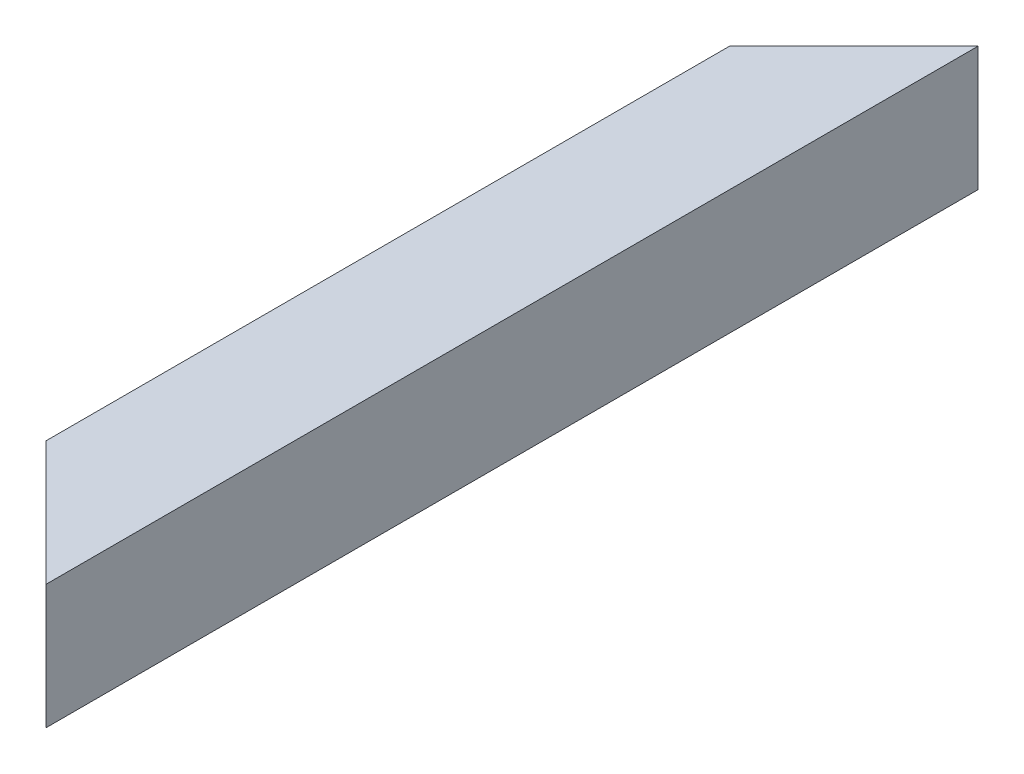
ISO-10303-21;
HEADER;
FILE_DESCRIPTION(('STEP AP214'),'2;1');
FILE_NAME('part.step','',(''),(''),'','','');
FILE_SCHEMA(('AUTOMOTIVE_DESIGN { 1 0 10303 214 1 1 1 1 }'));
ENDSEC;
DATA;
#1=APPLICATION_CONTEXT('core data for automotive mechanical design processes');
#2=APPLICATION_PROTOCOL_DEFINITION('international standard','automotive_design',2000,#1);
#3=PRODUCT_CONTEXT('',#1,'mechanical');
#4=PRODUCT('Part','Part','',(#3));
#5=PRODUCT_RELATED_PRODUCT_CATEGORY('part','',(#4));
#6=PRODUCT_DEFINITION_FORMATION('','',#4);
#7=PRODUCT_DEFINITION_CONTEXT('part definition',#1,'design');
#8=PRODUCT_DEFINITION('design','',#6,#7);
#9=PRODUCT_DEFINITION_SHAPE('','',#8);
#10=(LENGTH_UNIT() NAMED_UNIT(*) SI_UNIT(.MILLI.,.METRE.));
#11=(NAMED_UNIT(*) PLANE_ANGLE_UNIT() SI_UNIT($,.RADIAN.));
#12=(NAMED_UNIT(*) SI_UNIT($,.STERADIAN.) SOLID_ANGLE_UNIT());
#13=UNCERTAINTY_MEASURE_WITH_UNIT(LENGTH_MEASURE(1.E-05),#10,'distance_accuracy_value','');
#14=(GEOMETRIC_REPRESENTATION_CONTEXT(3) GLOBAL_UNCERTAINTY_ASSIGNED_CONTEXT((#13)) GLOBAL_UNIT_ASSIGNED_CONTEXT((#10,
#11,#12)) REPRESENTATION_CONTEXT('',''));
#15=CARTESIAN_POINT('',(0.,0.,0.));
#16=DIRECTION('',(0.,0.,1.));
#17=DIRECTION('',(1.,0.,0.));
#18=AXIS2_PLACEMENT_3D('',#15,#16,#17);
#19=CARTESIAN_POINT('',(-16.,16.,0.));
#20=DIRECTION('',(1.,0.,0.));
#21=DIRECTION('',(0.,0.,-1.));
#22=AXIS2_PLACEMENT_3D('',#19,#20,#21);
#23=PLANE('',#22);
#24=DIRECTION('',(0.,-1.,0.));
#25=VECTOR('',#24,1.);
#26=CARTESIAN_POINT('',(-16.,16.,35.9999999999996));
#27=LINE('',#26,#25);
#28=CARTESIAN_POINT('',(-16.,16.,35.9999999999996));
#29=VERTEX_POINT('',#28);
#30=CARTESIAN_POINT('',(-16.,-16.,35.9999999999996));
#31=VERTEX_POINT('',#30);
#32=EDGE_CURVE('E11',#29,#31,#27,.T.);
#33=ORIENTED_EDGE('',*,*,#32,.F.);
#34=DIRECTION('',(0.,0.,1.));
#35=VECTOR('',#34,1.);
#36=CARTESIAN_POINT('',(-16.,16.,0.));
#37=LINE('',#36,#35);
#38=CARTESIAN_POINT('',(-16.,16.,264.000000000001));
#39=VERTEX_POINT('',#38);
#40=EDGE_CURVE('E148',#29,#39,#37,.T.);
#41=ORIENTED_EDGE('',*,*,#40,.T.);
#42=DIRECTION('',(0.,1.,0.));
#43=VECTOR('',#42,1.);
#44=CARTESIAN_POINT('',(-16.,16.,264.000000000001));
#45=LINE('',#44,#43);
#46=CARTESIAN_POINT('',(-16.,-16.,264.000000000001));
#47=VERTEX_POINT('',#46);
#48=EDGE_CURVE('E46',#47,#39,#45,.T.);
#49=ORIENTED_EDGE('',*,*,#48,.F.);
#50=DIRECTION('',(0.,0.,1.));
#51=VECTOR('',#50,1.);
#52=CARTESIAN_POINT('',(-16.,-16.,0.));
#53=LINE('',#52,#51);
#54=EDGE_CURVE('E135',#31,#47,#53,.T.);
#55=ORIENTED_EDGE('',*,*,#54,.F.);
#56=EDGE_LOOP('',(#33,#41,#49,#55));
#57=FACE_BOUND('',#56,.T.);
#58=ADVANCED_FACE('F38',(#57),#23,.T.);
#59=CARTESIAN_POINT('',(-16.,-16.,0.));
#60=DIRECTION('',(0.,1.,0.));
#61=DIRECTION('',(0.,0.,1.));
#62=AXIS2_PLACEMENT_3D('',#59,#60,#61);
#63=PLANE('',#62);
#64=DIRECTION('',(0.707106781186551,0.,-0.707106781186544));
#65=VECTOR('',#64,1.);
#66=CARTESIAN_POINT('',(1.99999999999982,-16.,18.));
#67=LINE('',#66,#65);
#68=CARTESIAN_POINT('',(16.,-16.,3.99999999999997));
#69=VERTEX_POINT('',#68);
#70=EDGE_CURVE('E168',#31,#69,#67,.T.);
#71=ORIENTED_EDGE('',*,*,#70,.F.);
#72=ORIENTED_EDGE('',*,*,#54,.T.);
#73=DIRECTION('',(-0.707106781186552,0.,-0.707106781186543));
#74=VECTOR('',#73,1.);
#75=CARTESIAN_POINT('',(-148.,-16.,132.000000000002));
#76=LINE('',#75,#74);
#77=CARTESIAN_POINT('',(16.,-16.,296.));
#78=VERTEX_POINT('',#77);
#79=EDGE_CURVE('E60',#78,#47,#76,.T.);
#80=ORIENTED_EDGE('',*,*,#79,.F.);
#81=DIRECTION('',(0.,0.,1.));
#82=VECTOR('',#81,1.);
#83=CARTESIAN_POINT('',(16.,-16.,0.));
#84=LINE('',#83,#82);
#85=EDGE_CURVE('E138',#69,#78,#84,.T.);
#86=ORIENTED_EDGE('',*,*,#85,.F.);
#87=EDGE_LOOP('',(#71,#72,#80,#86));
#88=FACE_BOUND('',#87,.T.);
#89=ADVANCED_FACE('F184',(#88),#63,.T.);
#90=CARTESIAN_POINT('',(16.,16.,0.));
#91=DIRECTION('',(-1.,0.,0.));
#92=DIRECTION('',(0.,0.,1.));
#93=AXIS2_PLACEMENT_3D('',#90,#91,#92);
#94=PLANE('',#93);
#95=DIRECTION('',(0.,1.,0.));
#96=VECTOR('',#95,1.);
#97=CARTESIAN_POINT('',(16.,16.,3.99999999999997));
#98=LINE('',#97,#96);
#99=CARTESIAN_POINT('',(16.,16.,3.99999999999997));
#100=VERTEX_POINT('',#99);
#101=EDGE_CURVE('E170',#69,#100,#98,.T.);
#102=ORIENTED_EDGE('',*,*,#101,.F.);
#103=ORIENTED_EDGE('',*,*,#85,.T.);
#104=DIRECTION('',(0.,-1.,0.));
#105=VECTOR('',#104,1.);
#106=CARTESIAN_POINT('',(16.,16.,296.));
#107=LINE('',#106,#105);
#108=CARTESIAN_POINT('',(16.,16.,296.));
#109=VERTEX_POINT('',#108);
#110=EDGE_CURVE('E164',#109,#78,#107,.T.);
#111=ORIENTED_EDGE('',*,*,#110,.F.);
#112=DIRECTION('',(0.,0.,1.));
#113=VECTOR('',#112,1.);
#114=CARTESIAN_POINT('',(16.,16.,0.));
#115=LINE('',#114,#113);
#116=EDGE_CURVE('E144',#100,#109,#115,.T.);
#117=ORIENTED_EDGE('',*,*,#116,.F.);
#118=EDGE_LOOP('',(#102,#103,#111,#117));
#119=FACE_BOUND('',#118,.T.);
#120=ADVANCED_FACE('F181',(#119),#94,.T.);
#121=CARTESIAN_POINT('',(-16.,16.,0.));
#122=DIRECTION('',(0.,-1.,0.));
#123=DIRECTION('',(0.,0.,-1.));
#124=AXIS2_PLACEMENT_3D('',#121,#122,#123);
#125=PLANE('',#124);
#126=DIRECTION('',(-0.707106781186551,0.,0.707106781186544));
#127=VECTOR('',#126,1.);
#128=CARTESIAN_POINT('',(1.99999999999982,16.,18.));
#129=LINE('',#128,#127);
#130=EDGE_CURVE('E52',#100,#29,#129,.T.);
#131=ORIENTED_EDGE('',*,*,#130,.F.);
#132=ORIENTED_EDGE('',*,*,#116,.T.);
#133=DIRECTION('',(0.707106781186552,0.,0.707106781186543));
#134=VECTOR('',#133,1.);
#135=CARTESIAN_POINT('',(-148.,16.,132.000000000002));
#136=LINE('',#135,#134);
#137=EDGE_CURVE('E166',#39,#109,#136,.T.);
#138=ORIENTED_EDGE('',*,*,#137,.F.);
#139=ORIENTED_EDGE('',*,*,#40,.F.);
#140=EDGE_LOOP('',(#131,#132,#138,#139));
#141=FACE_BOUND('',#140,.T.);
#142=ADVANCED_FACE('F176',(#141),#125,.T.);
#143=CARTESIAN_POINT('',(20.,-20.,300.));
#144=DIRECTION('',(0.707106781186543,0.,-0.707106781186552));
#145=DIRECTION('',(-0.707106781186552,0.,-0.707106781186543));
#146=AXIS2_PLACEMENT_3D('',#143,#144,#145);
#147=PLANE('',#146);
#148=ORIENTED_EDGE('',*,*,#137,.T.);
#149=ORIENTED_EDGE('',*,*,#110,.T.);
#150=ORIENTED_EDGE('',*,*,#79,.T.);
#151=ORIENTED_EDGE('',*,*,#48,.T.);
#152=EDGE_LOOP('',(#148,#149,#150,#151));
#153=FACE_BOUND('',#152,.T.);
#154=DIRECTION('',(-0.707106781186552,0.,-0.707106781186543));
#155=VECTOR('',#154,1.);
#156=CARTESIAN_POINT('',(20.,20.,300.));
#157=LINE('',#156,#155);
#158=CARTESIAN_POINT('',(20.,20.,300.));
#159=VERTEX_POINT('',#158);
#160=CARTESIAN_POINT('',(-20.,20.,260.000000000001));
#161=VERTEX_POINT('',#160);
#162=EDGE_CURVE('E157',#159,#161,#157,.T.);
#163=ORIENTED_EDGE('',*,*,#162,.T.);
#164=DIRECTION('',(0.,1.,0.));
#165=VECTOR('',#164,1.);
#166=CARTESIAN_POINT('',(-20.,-20.,260.000000000001));
#167=LINE('',#166,#165);
#168=CARTESIAN_POINT('',(-20.,-20.,260.000000000001));
#169=VERTEX_POINT('',#168);
#170=EDGE_CURVE('E159',#169,#161,#167,.T.);
#171=ORIENTED_EDGE('',*,*,#170,.F.);
#172=DIRECTION('',(-0.707106781186552,0.,-0.707106781186543));
#173=VECTOR('',#172,1.);
#174=CARTESIAN_POINT('',(20.,-20.,300.));
#175=LINE('',#174,#173);
#176=CARTESIAN_POINT('',(20.,-20.,300.));
#177=VERTEX_POINT('',#176);
#178=EDGE_CURVE('E125',#177,#169,#175,.T.);
#179=ORIENTED_EDGE('',*,*,#178,.F.);
#180=DIRECTION('',(0.,1.,0.));
#181=VECTOR('',#180,1.);
#182=CARTESIAN_POINT('',(20.,20.,300.));
#183=LINE('',#182,#181);
#184=EDGE_CURVE('E147',#177,#159,#183,.T.);
#185=ORIENTED_EDGE('',*,*,#184,.T.);
#186=EDGE_LOOP('',(#163,#171,#179,#185));
#187=FACE_BOUND('',#186,.T.);
#188=ADVANCED_FACE('F183',(#153,#187),#147,.F.);
#189=CARTESIAN_POINT('',(20.,-20.,0.));
#190=DIRECTION('',(0.707106781186544,0.,0.707106781186551));
#191=DIRECTION('',(0.707106781186551,0.,-0.707106781186544));
#192=AXIS2_PLACEMENT_3D('',#189,#190,#191);
#193=PLANE('',#192);
#194=ORIENTED_EDGE('',*,*,#130,.T.);
#195=ORIENTED_EDGE('',*,*,#32,.T.);
#196=ORIENTED_EDGE('',*,*,#70,.T.);
#197=ORIENTED_EDGE('',*,*,#101,.T.);
#198=EDGE_LOOP('',(#194,#195,#196,#197));
#199=FACE_BOUND('',#198,.T.);
#200=DIRECTION('',(0.707106781186551,0.,-0.707106781186544));
#201=VECTOR('',#200,1.);
#202=CARTESIAN_POINT('',(20.,20.,0.));
#203=LINE('',#202,#201);
#204=CARTESIAN_POINT('',(-20.,20.,39.9999999999996));
#205=VERTEX_POINT('',#204);
#206=CARTESIAN_POINT('',(20.,20.,0.));
#207=VERTEX_POINT('',#206);
#208=EDGE_CURVE('E112',#205,#207,#203,.T.);
#209=ORIENTED_EDGE('',*,*,#208,.T.);
#210=DIRECTION('',(0.,1.,0.));
#211=VECTOR('',#210,1.);
#212=CARTESIAN_POINT('',(20.,20.,0.));
#213=LINE('',#212,#211);
#214=CARTESIAN_POINT('',(20.,-20.,0.));
#215=VERTEX_POINT('',#214);
#216=EDGE_CURVE('E107',#215,#207,#213,.T.);
#217=ORIENTED_EDGE('',*,*,#216,.F.);
#218=DIRECTION('',(0.707106781186551,0.,-0.707106781186544));
#219=VECTOR('',#218,1.);
#220=CARTESIAN_POINT('',(20.,-20.,0.));
#221=LINE('',#220,#219);
#222=CARTESIAN_POINT('',(-20.,-20.,39.9999999999996));
#223=VERTEX_POINT('',#222);
#224=EDGE_CURVE('E101',#223,#215,#221,.T.);
#225=ORIENTED_EDGE('',*,*,#224,.F.);
#226=DIRECTION('',(0.,1.,0.));
#227=VECTOR('',#226,1.);
#228=CARTESIAN_POINT('',(-20.,-20.,39.9999999999996));
#229=LINE('',#228,#227);
#230=EDGE_CURVE('E104',#223,#205,#229,.T.);
#231=ORIENTED_EDGE('',*,*,#230,.T.);
#232=EDGE_LOOP('',(#209,#217,#225,#231));
#233=FACE_BOUND('',#232,.T.);
#234=ADVANCED_FACE('F103',(#199,#233),#193,.F.);
#235=CARTESIAN_POINT('',(-20.,20.,0.));
#236=DIRECTION('',(-1.,0.,0.));
#237=DIRECTION('',(0.,0.,1.));
#238=AXIS2_PLACEMENT_3D('',#235,#236,#237);
#239=PLANE('',#238);
#240=ORIENTED_EDGE('',*,*,#230,.F.);
#241=DIRECTION('',(0.,0.,1.));
#242=VECTOR('',#241,1.);
#243=CARTESIAN_POINT('',(-20.,-20.,0.));
#244=LINE('',#243,#242);
#245=EDGE_CURVE('E119',#223,#169,#244,.T.);
#246=ORIENTED_EDGE('',*,*,#245,.T.);
#247=ORIENTED_EDGE('',*,*,#170,.T.);
#248=DIRECTION('',(0.,0.,1.));
#249=VECTOR('',#248,1.);
#250=CARTESIAN_POINT('',(-20.,20.,0.));
#251=LINE('',#250,#249);
#252=EDGE_CURVE('E121',#205,#161,#251,.T.);
#253=ORIENTED_EDGE('',*,*,#252,.F.);
#254=EDGE_LOOP('',(#240,#246,#247,#253));
#255=FACE_BOUND('',#254,.T.);
#256=ADVANCED_FACE('F117',(#255),#239,.T.);
#257=CARTESIAN_POINT('',(-20.,-20.,0.));
#258=DIRECTION('',(0.,-1.,0.));
#259=DIRECTION('',(0.,0.,-1.));
#260=AXIS2_PLACEMENT_3D('',#257,#258,#259);
#261=PLANE('',#260);
#262=ORIENTED_EDGE('',*,*,#224,.T.);
#263=DIRECTION('',(0.,0.,1.));
#264=VECTOR('',#263,1.);
#265=CARTESIAN_POINT('',(20.,-20.,0.));
#266=LINE('',#265,#264);
#267=EDGE_CURVE('E126',#215,#177,#266,.T.);
#268=ORIENTED_EDGE('',*,*,#267,.T.);
#269=ORIENTED_EDGE('',*,*,#178,.T.);
#270=ORIENTED_EDGE('',*,*,#245,.F.);
#271=EDGE_LOOP('',(#262,#268,#269,#270));
#272=FACE_BOUND('',#271,.T.);
#273=ADVANCED_FACE('F124',(#272),#261,.T.);
#274=CARTESIAN_POINT('',(20.,20.,0.));
#275=DIRECTION('',(1.,0.,0.));
#276=DIRECTION('',(0.,0.,-1.));
#277=AXIS2_PLACEMENT_3D('',#274,#275,#276);
#278=PLANE('',#277);
#279=DIRECTION('',(0.,0.,1.));
#280=VECTOR('',#279,1.);
#281=CARTESIAN_POINT('',(20.,20.,0.));
#282=LINE('',#281,#280);
#283=EDGE_CURVE('E128',#207,#159,#282,.T.);
#284=ORIENTED_EDGE('',*,*,#283,.T.);
#285=ORIENTED_EDGE('',*,*,#184,.F.);
#286=ORIENTED_EDGE('',*,*,#267,.F.);
#287=ORIENTED_EDGE('',*,*,#216,.T.);
#288=EDGE_LOOP('',(#284,#285,#286,#287));
#289=FACE_BOUND('',#288,.T.);
#290=ADVANCED_FACE('F155',(#289),#278,.T.);
#291=CARTESIAN_POINT('',(-20.,20.,0.));
#292=DIRECTION('',(0.,1.,0.));
#293=DIRECTION('',(0.,0.,1.));
#294=AXIS2_PLACEMENT_3D('',#291,#292,#293);
#295=PLANE('',#294);
#296=ORIENTED_EDGE('',*,*,#208,.F.);
#297=ORIENTED_EDGE('',*,*,#252,.T.);
#298=ORIENTED_EDGE('',*,*,#162,.F.);
#299=ORIENTED_EDGE('',*,*,#283,.F.);
#300=EDGE_LOOP('',(#296,#297,#298,#299));
#301=FACE_BOUND('',#300,.T.);
#302=ADVANCED_FACE('F40',(#301),#295,.T.);
#303=CLOSED_SHELL('',(#58,#89,#120,#142,#188,#234,#256,#273,#290,#302));
#304=MANIFOLD_SOLID_BREP('B2',#303);
#305=ADVANCED_BREP_SHAPE_REPRESENTATION('',(#18,#304),#14);
#306=SHAPE_DEFINITION_REPRESENTATION(#9,#305);
ENDSEC;
END-ISO-10303-21;
